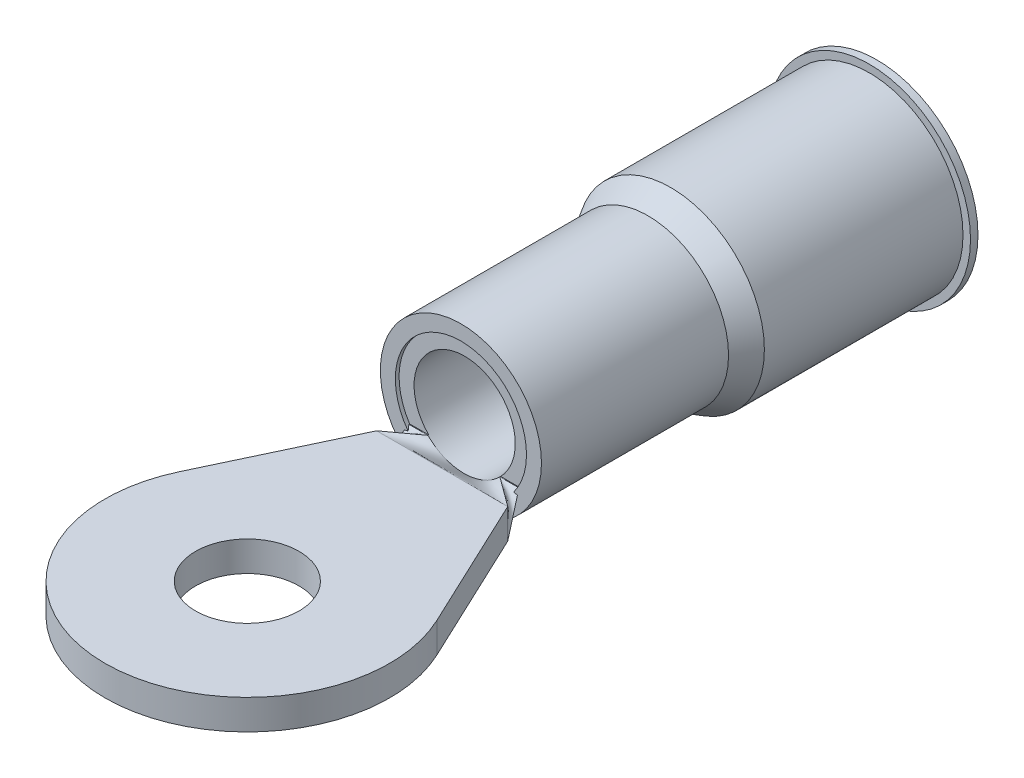
ISO-10303-21;
HEADER;
FILE_DESCRIPTION(('STEP AP214'),'2;1');
FILE_NAME('part.step','',(''),(''),'','','');
FILE_SCHEMA(('AUTOMOTIVE_DESIGN { 1 0 10303 214 1 1 1 1 }'));
ENDSEC;
DATA;
#1=APPLICATION_CONTEXT('core data for automotive mechanical design processes');
#2=APPLICATION_PROTOCOL_DEFINITION('international standard','automotive_design',2000,#1);
#3=PRODUCT_CONTEXT('',#1,'mechanical');
#4=PRODUCT('Part','Part','',(#3));
#5=PRODUCT_RELATED_PRODUCT_CATEGORY('part','',(#4));
#6=PRODUCT_DEFINITION_FORMATION('','',#4);
#7=PRODUCT_DEFINITION_CONTEXT('part definition',#1,'design');
#8=PRODUCT_DEFINITION('design','',#6,#7);
#9=PRODUCT_DEFINITION_SHAPE('','',#8);
#10=(LENGTH_UNIT() NAMED_UNIT(*) SI_UNIT(.MILLI.,.METRE.));
#11=(NAMED_UNIT(*) PLANE_ANGLE_UNIT() SI_UNIT($,.RADIAN.));
#12=(NAMED_UNIT(*) SI_UNIT($,.STERADIAN.) SOLID_ANGLE_UNIT());
#13=UNCERTAINTY_MEASURE_WITH_UNIT(LENGTH_MEASURE(1.E-05),#10,'distance_accuracy_value','');
#14=(GEOMETRIC_REPRESENTATION_CONTEXT(3) GLOBAL_UNCERTAINTY_ASSIGNED_CONTEXT((#13)) GLOBAL_UNIT_ASSIGNED_CONTEXT((#10,
#11,#12)) REPRESENTATION_CONTEXT('',''));
#15=CARTESIAN_POINT('',(0.,0.,0.));
#16=DIRECTION('',(0.,0.,1.));
#17=DIRECTION('',(1.,0.,0.));
#18=AXIS2_PLACEMENT_3D('',#15,#16,#17);
#19=CARTESIAN_POINT('',(-1.86651118400078,1.016,0.0254));
#20=CARTESIAN_POINT('',(-1.98517412266719,0.677333333333334,0.270933333333333));
#21=CARTESIAN_POINT('',(-2.10383706133359,0.338666666666667,0.516466666666667));
#22=CARTESIAN_POINT('',(-2.2225,0.,0.762));
#23=CARTESIAN_POINT('',(-1.76415740937807,0.857653986690439,0.0254));
#24=CARTESIAN_POINT('',(-1.8552021618076,0.571769324460293,0.270933333333333));
#25=CARTESIAN_POINT('',(-1.94624691423714,0.285884662230147,0.516466666666667));
#26=CARTESIAN_POINT('',(-2.03729166666667,0.,0.762));
#27=CARTESIAN_POINT('',(-1.52156969671564,0.572381544803947,0.0254));
#28=CARTESIAN_POINT('',(-1.57000479781043,0.381587696535965,0.270933333333333));
#29=CARTESIAN_POINT('',(-1.61843989890521,0.190793848267982,0.516466666666667));
#30=CARTESIAN_POINT('',(-1.666875,0.,0.762));
#31=CARTESIAN_POINT('',(-0.926796873757692,0.143518849263501,0.0254));
#32=CARTESIAN_POINT('',(-0.926545138060684,0.0956792328423337,0.270933333333333));
#33=CARTESIAN_POINT('',(-0.926293402363676,0.0478396164211668,0.516466666666667));
#34=CARTESIAN_POINT('',(-0.926041666666668,0.,0.762));
#35=CARTESIAN_POINT('',(0.000122281378611678,-0.0963050950338614,0.0254));
#36=CARTESIAN_POINT('',(8.15209190738013E-05,-0.0642033966892409,0.270933333333333));
#37=CARTESIAN_POINT('',(4.07604595359249E-05,-0.0321016983446204,0.516466666666666));
#38=CARTESIAN_POINT('',(0.,0.,0.761999999999999));
#39=CARTESIAN_POINT('',(0.926558741621469,0.143457379872482,0.0254000000000001));
#40=CARTESIAN_POINT('',(0.926386383303201,0.0956382532483216,0.270933333333333));
#41=CARTESIAN_POINT('',(0.926214024984933,0.0478191266241608,0.516466666666667));
#42=CARTESIAN_POINT('',(0.926041666666666,0.,0.762));
#43=CARTESIAN_POINT('',(1.52161395362113,0.57237120881408,0.0254));
#44=CARTESIAN_POINT('',(1.57003430241409,0.381580805876053,0.270933333333333));
#45=CARTESIAN_POINT('',(1.61845465120704,0.190790402938027,0.516466666666667));
#46=CARTESIAN_POINT('',(1.666875,0.,0.762));
#47=CARTESIAN_POINT('',(1.76415740937807,0.857653986690438,0.0254));
#48=CARTESIAN_POINT('',(1.8552021618076,0.571769324460292,0.270933333333333));
#49=CARTESIAN_POINT('',(1.94624691423713,0.285884662230146,0.516466666666667));
#50=CARTESIAN_POINT('',(2.03729166666666,0.,0.762));
#51=CARTESIAN_POINT('',(1.86651118400078,1.016,0.0254));
#52=CARTESIAN_POINT('',(1.98517412266719,0.677333333333333,0.270933333333333));
#53=CARTESIAN_POINT('',(2.10383706133359,0.338666666666666,0.516466666666667));
#54=CARTESIAN_POINT('',(2.2225,0.,0.762));
#55=B_SPLINE_SURFACE_WITH_KNOTS('',3,3,((#19,#20,#21,#22),(#23,#24,#25,#26),(#27,#28,#29,#30),
(#31,#32,#33,#34),(#35,#36,#37,#38),(#39,#40,#41,#42),(#43,#44,#45,#46),(#47,#48,#49,#50),(#51,
#52,#53,#54)),.UNSPECIFIED.,.F.,.F.,.F.,(4,1,1,1,1,1,4),(4,4),(0.,0.125,0.25,0.5,0.75,0.875,1.),
(0.,1.),.UNSPECIFIED.);
#56=DIRECTION('',(0.272905482953707,0.778878319260385,-0.564686781463779));
#57=VECTOR('',#56,1.);
#58=CARTESIAN_POINT('',(-2.04450559200039,0.508,0.3937));
#59=LINE('',#58,#57);
#60=CARTESIAN_POINT('',(-2.2225,0.,0.762));
#61=VERTEX_POINT('',#60);
#62=CARTESIAN_POINT('',(-1.91561308965585,0.875862068965517,0.127));
#63=VERTEX_POINT('',#62);
#64=EDGE_CURVE('E163',#61,#63,#59,.T.);
#65=CARTESIAN_POINT('',(-1.91561308965585,0.875862068965517,0.127));
#66=CARTESIAN_POINT('',(-1.88031346830762,0.83351286184279,0.127));
#67=CARTESIAN_POINT('',(-1.84345220574068,0.792479319937373,0.127));
#68=CARTESIAN_POINT('',(-1.76690702388937,0.713166538929917,0.127));
#69=CARTESIAN_POINT('',(-1.72722430124693,0.674886145852207,0.127));
#70=CARTESIAN_POINT('',(-1.6453538665632,0.601209300898592,0.127));
#71=CARTESIAN_POINT('',(-1.60316909947475,0.565809570480815,0.127));
#72=CARTESIAN_POINT('',(-1.51651304693073,0.497913992094239,0.127));
#73=CARTESIAN_POINT('',(-1.4720412307676,0.465418822959703,0.127));
#74=CARTESIAN_POINT('',(-1.37149298147968,0.397014857809891,0.127));
#75=CARTESIAN_POINT('',(-1.31493333838839,0.361811425932884,0.127));
#76=CARTESIAN_POINT('',(-1.19915375854194,0.296140751778514,0.127));
#77=CARTESIAN_POINT('',(-1.13993382336656,0.265673506688685,0.127));
#78=CARTESIAN_POINT('',(-0.95874434701809,0.181557656021093,0.127));
#79=CARTESIAN_POINT('',(-0.833266823312771,0.135209636342761,0.127));
#80=CARTESIAN_POINT('',(-0.637755102908725,0.0795749988279614,0.127));
#81=CARTESIAN_POINT('',(-0.569624326745305,0.0631336735664818,0.127));
#82=CARTESIAN_POINT('',(-0.432237730962836,0.0357761923262529,0.127));
#83=CARTESIAN_POINT('',(-0.36298192940178,0.0248599477536575,0.127));
#84=CARTESIAN_POINT('',(-0.223824436444734,0.00867844257119852,0.127));
#85=CARTESIAN_POINT('',(-0.153922823091541,0.0034125079333443,0.127));
#86=CARTESIAN_POINT('',(-0.0139239110792396,-0.00125998044247287,0.127));
#87=CARTESIAN_POINT('',(0.0561733761045003,-0.000666870857447165,0.127));
#88=CARTESIAN_POINT('',(0.198186642331982,0.00644182516274476,0.127));
#89=CARTESIAN_POINT('',(0.270093620798593,0.0131357137162563,0.127));
#90=CARTESIAN_POINT('',(0.413109844585491,0.0324871502347966,0.127));
#91=CARTESIAN_POINT('',(0.484218947643138,0.0451457449470441,0.127));
#92=CARTESIAN_POINT('',(0.625194891618926,0.0763223092276175,0.127));
#93=CARTESIAN_POINT('',(0.695060805433234,0.094844472788575,0.127));
#94=CARTESIAN_POINT('',(0.832993419885325,0.137659924457198,0.127));
#95=CARTESIAN_POINT('',(0.901060381220419,0.161952371204842,0.127));
#96=CARTESIAN_POINT('',(1.03537810898253,0.216518828055234,0.127));
#97=CARTESIAN_POINT('',(1.10161060948659,0.246837935402359,0.127));
#98=CARTESIAN_POINT('',(1.23112540724198,0.313256535567639,0.127));
#99=CARTESIAN_POINT('',(1.29440731440598,0.349356789908405,0.127));
#100=CARTESIAN_POINT('',(1.41737528821745,0.42696091284632,0.127));
#101=CARTESIAN_POINT('',(1.47706863508211,0.468453261262636,0.127));
#102=CARTESIAN_POINT('',(1.59254812412097,0.556542904883816,0.127));
#103=CARTESIAN_POINT('',(1.64833531700027,0.603138818580735,0.127));
#104=CARTESIAN_POINT('',(1.73992481230505,0.6870468130533,0.127));
#105=CARTESIAN_POINT('',(1.77684173272019,0.723147862571424,0.127));
#106=CARTESIAN_POINT('',(1.84816469255455,0.797735266465607,0.127));
#107=CARTESIAN_POINT('',(1.8825712235021,0.836221151152803,0.127));
#108=CARTESIAN_POINT('',(1.91561308965585,0.875862068965516,0.127));
#109=B_SPLINE_CURVE_WITH_KNOTS('',3,(#65,#66,#67,#68,#69,#70,#71,#72,#73,#74,#75,#76,#77,#78,
#79,#80,#81,#82,#83,#84,#85,#86,#87,#88,#89,#90,#91,#92,#93,#94,#95,#96,#97,#98,#99,#100,#101,
#102,#103,#104,#105,#106,#107,#108),.UNSPECIFIED.,.F.,.F.,(4,2,2,2,2,2,2,2,2,2,2,2,2,2,2,2,2,2,
2,2,2,4),(0.,0.165342137350006,0.330614563100276,0.495696178609912,0.66081627553718,
0.860436577172999,1.06005676026886,1.45937483535704,1.66946790626083,1.87955760824678,
2.08962224575134,2.29967481242656,2.51607040486528,2.73250398675178,2.94909272663569,
3.16564990526663,3.38389309929961,3.60216506513879,3.81997813379678,4.03773238665957,
4.1925270249401,4.34729127300671),.UNSPECIFIED.);
#110=CARTESIAN_POINT('',(1.91561308965585,0.875862068965517,0.127));
#111=VERTEX_POINT('',#110);
#112=EDGE_CURVE('E268',#63,#111,#109,.T.);
#113=DIRECTION('',(0.272905482953706,-0.778878319260385,0.564686781463779));
#114=VECTOR('',#113,1.);
#115=CARTESIAN_POINT('',(2.04450559200039,0.508,0.3937));
#116=LINE('',#115,#114);
#117=CARTESIAN_POINT('',(2.2225,0.,0.762));
#118=VERTEX_POINT('',#117);
#119=EDGE_CURVE('E161',#111,#118,#116,.T.);
#120=DIRECTION('',(1.,0.,0.));
#121=VECTOR('',#120,1.);
#122=CARTESIAN_POINT('',(0.,0.,0.762));
#123=LINE('',#122,#121);
#124=EDGE_CURVE('E152',#118,#61,#123,.F.);
#125=ORIENTED_EDGE('',*,*,#64,.T.);
#126=ORIENTED_EDGE('',*,*,#112,.T.);
#127=ORIENTED_EDGE('',*,*,#119,.T.);
#128=ORIENTED_EDGE('',*,*,#124,.T.);
#129=EDGE_LOOP('',(#125,#126,#127,#128));
#130=FACE_BOUND('',#129,.T.);
#131=ADVANCED_FACE('F78',(#130),#55,.T.);
#132=CARTESIAN_POINT('',(-1.21814120692143,1.016,0.0254));
#133=CARTESIAN_POINT('',(-1.55292747128095,1.016,0.270933333333333));
#134=CARTESIAN_POINT('',(-1.88771373564048,1.016,0.516466666666667));
#135=CARTESIAN_POINT('',(-2.2225,1.016,0.762));
#136=CARTESIAN_POINT('',(-1.27217203834471,1.016,0.0254));
#137=CARTESIAN_POINT('',(-1.58894802556314,0.987777777777777,0.270933333333333));
#138=CARTESIAN_POINT('',(-1.90572401278157,0.959555555555555,0.516466666666667));
#139=CARTESIAN_POINT('',(-2.2225,0.931333333333333,0.762));
#140=CARTESIAN_POINT('',(-1.38023370119127,1.016,0.0254));
#141=CARTESIAN_POINT('',(-1.66098913412751,0.931333333333332,0.270933333333333));
#142=CARTESIAN_POINT('',(-1.94174456706376,0.846666666666666,0.516466666666667));
#143=CARTESIAN_POINT('',(-2.2225,0.762,0.762));
#144=CARTESIAN_POINT('',(-1.5423261954611,1.016,0.0254));
#145=CARTESIAN_POINT('',(-1.76905079697407,0.846666666666667,0.270933333333333));
#146=CARTESIAN_POINT('',(-1.99577539848704,0.677333333333333,0.516466666666667));
#147=CARTESIAN_POINT('',(-2.2225,0.508,0.762));
#148=CARTESIAN_POINT('',(-1.70441868973095,1.016,0.0254));
#149=CARTESIAN_POINT('',(-1.87711245982063,0.761999999999999,0.270933333333333));
#150=CARTESIAN_POINT('',(-2.04980622991032,0.508,0.516466666666667));
#151=CARTESIAN_POINT('',(-2.2225,0.254,0.762));
#152=CARTESIAN_POINT('',(-1.8124803525775,1.016,0.0254));
#153=CARTESIAN_POINT('',(-1.949153568385,0.705555555555555,0.270933333333333));
#154=CARTESIAN_POINT('',(-2.0858267841925,0.395111111111111,0.516466666666667));
#155=CARTESIAN_POINT('',(-2.2225,0.0846666666666667,0.762));
#156=CARTESIAN_POINT('',(-1.86651118400078,1.016,0.0254));
#157=CARTESIAN_POINT('',(-1.98517412266719,0.677333333333333,0.270933333333333));
#158=CARTESIAN_POINT('',(-2.10383706133359,0.338666666666666,0.516466666666667));
#159=CARTESIAN_POINT('',(-2.2225,0.,0.762));
#160=B_SPLINE_SURFACE_WITH_KNOTS('',3,3,((#132,#133,#134,#135),(#136,#137,#138,#139),(#140,#141,
#142,#143),(#144,#145,#146,#147),(#148,#149,#150,#151),(#152,#153,#154,#155),(#156,#157,#158,
#159)),.UNSPECIFIED.,.F.,.F.,.F.,(4,1,1,1,4),(4,4),(0.84092580565334,0.880694354240005,
0.92046290282667,0.960231451413335,1.),(0.,1.),.UNSPECIFIED.);
#161=CARTESIAN_POINT('',(-1.86651118400078,1.016,0.0254000000000001));
#162=CARTESIAN_POINT('',(-1.8621898983026,1.00931434022097,0.0302490740204463));
#163=CARTESIAN_POINT('',(-1.85786269151016,1.0026991682149,0.0351927535176043));
#164=CARTESIAN_POINT('',(-1.84923429555042,0.989657985593923,0.0452890310326855));
#165=CARTESIAN_POINT('',(-1.84493306772688,0.983231418504407,0.0504408786617088));
#166=CARTESIAN_POINT('',(-1.83637514284163,0.970585156102389,0.060992996866067));
#167=CARTESIAN_POINT('',(-1.83211836676651,0.96436502364961,0.0663926759694745));
#168=CARTESIAN_POINT('',(-1.82366870473624,0.952148099195494,0.0775020339984391));
#169=CARTESIAN_POINT('',(-1.81947588348651,0.94615152553031,0.0832120032503846));
#170=CARTESIAN_POINT('',(-1.81119576733252,0.934428781169385,0.0949986802182849));
#171=CARTESIAN_POINT('',(-1.80710862047376,0.928702981401108,0.101075866435901));
#172=CARTESIAN_POINT('',(-1.79909498490028,0.917581842953821,0.113684670748279));
#173=CARTESIAN_POINT('',(-1.79516931465016,0.912188131932854,0.120218236453412));
#174=CARTESIAN_POINT('',(-1.79136816548423,0.907012886536106,0.126999999998449));
#175=B_SPLINE_CURVE_WITH_KNOTS('',3,(#161,#162,#163,#164,#165,#166,#167,#168,#169,#170,#171,
#172,#173,#174),.UNSPECIFIED.,.F.,.F.,(4,2,2,2,2,2,4),(0.,0.0279649760583425,0.055836843748949,
0.0836453392655018,0.111480317776658,0.139352383310867,0.167351668944471),.UNSPECIFIED.);
#176=CARTESIAN_POINT('',(-1.86651118400078,1.016,0.0254000000000001));
#177=VERTEX_POINT('',#176);
#178=CARTESIAN_POINT('',(-1.79136816548425,0.907012886536092,0.127));
#179=VERTEX_POINT('',#178);
#180=EDGE_CURVE('E237',#177,#179,#175,.T.);
#181=CARTESIAN_POINT('',(-1.35667345424261,1.016,0.127));
#182=CARTESIAN_POINT('',(-1.43928364215626,0.995287887129297,0.127));
#183=CARTESIAN_POINT('',(-1.52189383006991,0.974575774258593,0.127));
#184=CARTESIAN_POINT('',(-1.65635552992894,0.94086339598416,0.127));
#185=CARTESIAN_POINT('',(-1.70820704187433,0.927863130580431,0.127));
#186=CARTESIAN_POINT('',(-1.81191006576509,0.901862599772973,0.127));
#187=CARTESIAN_POINT('',(-1.86376157771047,0.888862334369245,0.127));
#188=CARTESIAN_POINT('',(-1.91561308965585,0.875862068965516,0.127));
#189=B_SPLINE_CURVE_WITH_KNOTS('',3,(#181,#182,#183,#184,#185,#186,#187,#188),.UNSPECIFIED.,.F.,
.F.,(4,2,2,4),(0.,0.255501297257522,0.415870482964452,0.576239668671382),.UNSPECIFIED.);
#190=EDGE_CURVE('E262',#179,#63,#189,.T.);
#191=DIRECTION('',(0.,1.,0.));
#192=VECTOR('',#191,1.);
#193=CARTESIAN_POINT('',(-2.2225,1.016,0.762));
#194=LINE('',#193,#192);
#195=CARTESIAN_POINT('',(-2.2225,1.016,0.762));
#196=VERTEX_POINT('',#195);
#197=EDGE_CURVE('E145',#196,#61,#194,.F.);
#198=DIRECTION('',(-0.806378110106925,0.,0.591400324264692));
#199=VECTOR('',#198,1.);
#200=CARTESIAN_POINT('',(-1.72032060346072,1.016,0.3937));
#201=LINE('',#200,#199);
#202=CARTESIAN_POINT('',(-1.21814120692143,1.016,0.0254));
#203=VERTEX_POINT('',#202);
#204=EDGE_CURVE('E283',#203,#196,#201,.T.);
#205=DIRECTION('',(-1.,0.,0.));
#206=VECTOR('',#205,1.);
#207=CARTESIAN_POINT('',(-1.21814120692143,1.016,0.0254));
#208=LINE('',#207,#206);
#209=EDGE_CURVE('E277',#203,#177,#208,.T.);
#210=ORIENTED_EDGE('',*,*,#180,.T.);
#211=ORIENTED_EDGE('',*,*,#190,.T.);
#212=ORIENTED_EDGE('',*,*,#64,.F.);
#213=ORIENTED_EDGE('',*,*,#197,.F.);
#214=ORIENTED_EDGE('',*,*,#204,.F.);
#215=ORIENTED_EDGE('',*,*,#209,.T.);
#216=EDGE_LOOP('',(#210,#211,#212,#213,#214,#215));
#217=FACE_BOUND('',#216,.T.);
#218=ADVANCED_FACE('F195',(#217),#160,.T.);
#219=CARTESIAN_POINT('',(1.86651118400078,1.016,0.0254));
#220=CARTESIAN_POINT('',(1.98517412266719,0.677333333333333,0.270933333333333));
#221=CARTESIAN_POINT('',(2.10383706133359,0.338666666666666,0.516466666666667));
#222=CARTESIAN_POINT('',(2.2225,0.,0.762));
#223=CARTESIAN_POINT('',(1.8124803525775,1.016,0.0254));
#224=CARTESIAN_POINT('',(1.949153568385,0.705555555555555,0.270933333333333));
#225=CARTESIAN_POINT('',(2.0858267841925,0.395111111111111,0.516466666666667));
#226=CARTESIAN_POINT('',(2.2225,0.0846666666666667,0.762));
#227=CARTESIAN_POINT('',(1.70441868973095,1.016,0.0254));
#228=CARTESIAN_POINT('',(1.87711245982063,0.762,0.270933333333334));
#229=CARTESIAN_POINT('',(2.04980622991032,0.508,0.516466666666667));
#230=CARTESIAN_POINT('',(2.2225,0.254000000000001,0.762000000000001));
#231=CARTESIAN_POINT('',(1.54232619546111,1.016,0.0254));
#232=CARTESIAN_POINT('',(1.76905079697407,0.846666666666666,0.270933333333333));
#233=CARTESIAN_POINT('',(1.99577539848704,0.677333333333333,0.516466666666666));
#234=CARTESIAN_POINT('',(2.2225,0.507999999999999,0.761999999999999));
#235=CARTESIAN_POINT('',(1.38023370119127,1.016,0.0254));
#236=CARTESIAN_POINT('',(1.66098913412751,0.931333333333333,0.270933333333333));
#237=CARTESIAN_POINT('',(1.94174456706376,0.846666666666667,0.516466666666667));
#238=CARTESIAN_POINT('',(2.2225,0.762000000000001,0.762));
#239=CARTESIAN_POINT('',(1.27217203834471,1.016,0.0254));
#240=CARTESIAN_POINT('',(1.58894802556314,0.987777777777778,0.270933333333333));
#241=CARTESIAN_POINT('',(1.90572401278157,0.959555555555555,0.516466666666667));
#242=CARTESIAN_POINT('',(2.2225,0.931333333333333,0.762));
#243=CARTESIAN_POINT('',(1.21814120692143,1.016,0.0254));
#244=CARTESIAN_POINT('',(1.55292747128095,1.016,0.270933333333333));
#245=CARTESIAN_POINT('',(1.88771373564048,1.016,0.516466666666667));
#246=CARTESIAN_POINT('',(2.2225,1.016,0.762));
#247=B_SPLINE_SURFACE_WITH_KNOTS('',3,3,((#219,#220,#221,#222),(#223,#224,#225,#226),(#227,#228,
#229,#230),(#231,#232,#233,#234),(#235,#236,#237,#238),(#239,#240,#241,#242),(#243,#244,#245,
#246)),.UNSPECIFIED.,.F.,.F.,.F.,(4,1,1,1,4),(4,4),(0.,0.0397685485866649,0.0795370971733298,
0.119305645759995,0.15907419434666),(0.,1.),.UNSPECIFIED.);
#248=CARTESIAN_POINT('',(1.91561308965585,0.875862068965517,0.127));
#249=CARTESIAN_POINT('',(1.83300290174219,0.896574181836221,0.127));
#250=CARTESIAN_POINT('',(1.75039271382854,0.917286294706925,0.127));
#251=CARTESIAN_POINT('',(1.61593101396951,0.950998672981357,0.127));
#252=CARTESIAN_POINT('',(1.56407950202413,0.963998938385086,0.127));
#253=CARTESIAN_POINT('',(1.46037647813337,0.989999469192543,0.127));
#254=CARTESIAN_POINT('',(1.40852496618799,1.00299973459627,0.127));
#255=CARTESIAN_POINT('',(1.35667345424261,1.016,0.127));
#256=B_SPLINE_CURVE_WITH_KNOTS('',3,(#248,#249,#250,#251,#252,#253,#254,#255),.UNSPECIFIED.,.F.,
.F.,(4,2,2,4),(0.,0.255501297257528,0.415870482964455,0.576239668671382),.UNSPECIFIED.);
#257=CARTESIAN_POINT('',(1.79136816548339,0.907012886534918,0.127));
#258=VERTEX_POINT('',#257);
#259=EDGE_CURVE('E13',#111,#258,#256,.T.);
#260=CARTESIAN_POINT('',(1.79136816548339,0.907012886534918,0.127));
#261=CARTESIAN_POINT('',(1.79516931464933,0.912188131931705,0.120218236454834));
#262=CARTESIAN_POINT('',(1.79909498489948,0.917581842952716,0.113684670749584));
#263=CARTESIAN_POINT('',(1.80710862047304,0.928702981400102,0.10107586643699));
#264=CARTESIAN_POINT('',(1.81119576733184,0.934428781168434,0.0949986802192751));
#265=CARTESIAN_POINT('',(1.81947588348593,0.946151525529477,0.0832120032511893));
#266=CARTESIAN_POINT('',(1.82366870473571,0.952148099194727,0.077502033999157));
#267=CARTESIAN_POINT('',(1.83211836676608,0.964365023648979,0.0663926759700289));
#268=CARTESIAN_POINT('',(1.83637514284125,0.97058515610183,0.0609929968665448));
#269=CARTESIAN_POINT('',(1.8449330677266,0.983231418503998,0.0504408786620402));
#270=CARTESIAN_POINT('',(1.8492342955502,0.989657985593592,0.045289031032947));
#271=CARTESIAN_POINT('',(1.85786269151005,1.00269916821473,0.0351927535177313));
#272=CARTESIAN_POINT('',(1.86218989830255,1.00931434022088,0.0302490740205087));
#273=CARTESIAN_POINT('',(1.86651118400078,1.016,0.0254));
#274=B_SPLINE_CURVE_WITH_KNOTS('',3,(#260,#261,#262,#263,#264,#265,#266,#267,#268,#269,#270,
#271,#272,#273),.UNSPECIFIED.,.F.,.F.,(4,2,2,2,2,2,4),(0.,0.0279992856339638,0.0558713511685266,
0.0837063296800339,0.111514825196936,0.139386692887896,0.167351668946597),.UNSPECIFIED.);
#275=CARTESIAN_POINT('',(1.86651118400078,1.016,0.0254));
#276=VERTEX_POINT('',#275);
#277=EDGE_CURVE('E89',#258,#276,#274,.T.);
#278=DIRECTION('',(-1.,0.,0.));
#279=VECTOR('',#278,1.);
#280=CARTESIAN_POINT('',(1.86651118400078,1.016,0.0254));
#281=LINE('',#280,#279);
#282=CARTESIAN_POINT('',(1.21814120692143,1.016,0.0254));
#283=VERTEX_POINT('',#282);
#284=EDGE_CURVE('E82',#276,#283,#281,.T.);
#285=DIRECTION('',(0.806378110106925,0.,0.591400324264693));
#286=VECTOR('',#285,1.);
#287=CARTESIAN_POINT('',(1.72032060346071,1.016,0.3937));
#288=LINE('',#287,#286);
#289=CARTESIAN_POINT('',(2.2225,1.016,0.762));
#290=VERTEX_POINT('',#289);
#291=EDGE_CURVE('E181',#283,#290,#288,.T.);
#292=DIRECTION('',(0.,1.,0.));
#293=VECTOR('',#292,1.);
#294=CARTESIAN_POINT('',(2.2225,1.016,0.762));
#295=LINE('',#294,#293);
#296=EDGE_CURVE('E128',#290,#118,#295,.F.);
#297=ORIENTED_EDGE('',*,*,#119,.F.);
#298=ORIENTED_EDGE('',*,*,#259,.T.);
#299=ORIENTED_EDGE('',*,*,#277,.T.);
#300=ORIENTED_EDGE('',*,*,#284,.T.);
#301=ORIENTED_EDGE('',*,*,#291,.T.);
#302=ORIENTED_EDGE('',*,*,#296,.T.);
#303=EDGE_LOOP('',(#297,#298,#299,#300,#301,#302));
#304=FACE_BOUND('',#303,.T.);
#305=ADVANCED_FACE('F183',(#304),#247,.T.);
#306=CARTESIAN_POINT('',(0.,1.016,7.366));
#307=DIRECTION('',(0.,1.,0.));
#308=DIRECTION('',(0.,0.,1.));
#309=AXIS2_PLACEMENT_3D('',#306,#307,#308);
#310=PLANE('',#309);
#311=CARTESIAN_POINT('',(0.,1.016,7.366));
#312=DIRECTION('',(0.,1.,0.));
#313=DIRECTION('',(0.,0.,1.));
#314=AXIS2_PLACEMENT_3D('',#311,#312,#313);
#315=CIRCLE('',#314,4.826);
#316=CARTESIAN_POINT('',(-4.36539668036592,1.016,5.30843157512315));
#317=VERTEX_POINT('',#316);
#318=CARTESIAN_POINT('',(4.36539668036592,1.016,5.30843157512315));
#319=VERTEX_POINT('',#318);
#320=EDGE_CURVE('E131',#317,#319,#315,.T.);
#321=ORIENTED_EDGE('',*,*,#320,.T.);
#322=DIRECTION('',(-0.426350688950861,0.,-0.904557952831728));
#323=VECTOR('',#322,1.);
#324=CARTESIAN_POINT('',(2.2225,1.016,0.762));
#325=LINE('',#324,#323);
#326=EDGE_CURVE('E118',#319,#290,#325,.T.);
#327=ORIENTED_EDGE('',*,*,#326,.T.);
#328=DIRECTION('',(1.,0.,0.));
#329=VECTOR('',#328,1.);
#330=CARTESIAN_POINT('',(0.,1.016,0.762));
#331=LINE('',#330,#329);
#332=EDGE_CURVE('E130',#290,#196,#331,.F.);
#333=ORIENTED_EDGE('',*,*,#332,.T.);
#334=DIRECTION('',(-0.426350688950861,0.,0.904557952831728));
#335=VECTOR('',#334,1.);
#336=CARTESIAN_POINT('',(-2.2225,1.016,0.762));
#337=LINE('',#336,#335);
#338=EDGE_CURVE('E98',#196,#317,#337,.T.);
#339=ORIENTED_EDGE('',*,*,#338,.T.);
#340=EDGE_LOOP('',(#321,#327,#333,#339));
#341=FACE_BOUND('',#340,.T.);
#342=CARTESIAN_POINT('',(0.,1.016,7.366));
#343=DIRECTION('',(0.,1.,0.));
#344=DIRECTION('',(0.,0.,1.));
#345=AXIS2_PLACEMENT_3D('',#342,#343,#344);
#346=CIRCLE('',#345,1.7526);
#347=CARTESIAN_POINT('',(0.,1.016,9.1186));
#348=VERTEX_POINT('',#347);
#349=EDGE_CURVE('E294',#348,#348,#346,.T.);
#350=ORIENTED_EDGE('',*,*,#349,.F.);
#351=EDGE_LOOP('',(#350));
#352=FACE_BOUND('',#351,.T.);
#353=ADVANCED_FACE('F134',(#341,#352),#310,.T.);
#354=CARTESIAN_POINT('',(0.,0.,7.366));
#355=DIRECTION('',(0.,1.,0.));
#356=DIRECTION('',(0.,0.,1.));
#357=AXIS2_PLACEMENT_3D('',#354,#355,#356);
#358=PLANE('',#357);
#359=CARTESIAN_POINT('',(0.,0.,7.366));
#360=DIRECTION('',(0.,1.,0.));
#361=DIRECTION('',(0.,0.,1.));
#362=AXIS2_PLACEMENT_3D('',#359,#360,#361);
#363=CIRCLE('',#362,4.826);
#364=CARTESIAN_POINT('',(-4.36539668036592,0.,5.30843157512315));
#365=VERTEX_POINT('',#364);
#366=CARTESIAN_POINT('',(4.36539668036592,0.,5.30843157512315));
#367=VERTEX_POINT('',#366);
#368=EDGE_CURVE('E141',#365,#367,#363,.T.);
#369=ORIENTED_EDGE('',*,*,#368,.F.);
#370=DIRECTION('',(-0.426350688950861,0.,0.904557952831728));
#371=VECTOR('',#370,1.);
#372=CARTESIAN_POINT('',(-2.2225,0.,0.762));
#373=LINE('',#372,#371);
#374=EDGE_CURVE('E138',#61,#365,#373,.T.);
#375=ORIENTED_EDGE('',*,*,#374,.F.);
#376=ORIENTED_EDGE('',*,*,#124,.F.);
#377=DIRECTION('',(-0.426350688950861,0.,-0.904557952831728));
#378=VECTOR('',#377,1.);
#379=CARTESIAN_POINT('',(2.2225,0.,0.762));
#380=LINE('',#379,#378);
#381=EDGE_CURVE('E151',#367,#118,#380,.T.);
#382=ORIENTED_EDGE('',*,*,#381,.F.);
#383=EDGE_LOOP('',(#369,#375,#376,#382));
#384=FACE_BOUND('',#383,.T.);
#385=CARTESIAN_POINT('',(0.,0.,7.366));
#386=DIRECTION('',(0.,1.,0.));
#387=DIRECTION('',(0.,0.,1.));
#388=AXIS2_PLACEMENT_3D('',#385,#386,#387);
#389=CIRCLE('',#388,1.7526);
#390=CARTESIAN_POINT('',(0.,0.,9.1186));
#391=VERTEX_POINT('',#390);
#392=EDGE_CURVE('E290',#391,#391,#389,.T.);
#393=ORIENTED_EDGE('',*,*,#392,.T.);
#394=EDGE_LOOP('',(#393));
#395=FACE_BOUND('',#394,.T.);
#396=ADVANCED_FACE('F457',(#384,#395),#358,.F.);
#397=CARTESIAN_POINT('',(0.,1.016,7.366));
#398=DIRECTION('',(0.,-1.,0.));
#399=DIRECTION('',(0.,0.,-1.));
#400=AXIS2_PLACEMENT_3D('',#397,#398,#399);
#401=CYLINDRICAL_SURFACE('',#400,4.826);
#402=ORIENTED_EDGE('',*,*,#368,.T.);
#403=DIRECTION('',(0.,-1.,0.));
#404=VECTOR('',#403,1.);
#405=CARTESIAN_POINT('',(4.36539668036592,1.016,5.30843157512315));
#406=LINE('',#405,#404);
#407=EDGE_CURVE('E125',#319,#367,#406,.T.);
#408=ORIENTED_EDGE('',*,*,#407,.F.);
#409=ORIENTED_EDGE('',*,*,#320,.F.);
#410=DIRECTION('',(0.,-1.,0.));
#411=VECTOR('',#410,1.);
#412=CARTESIAN_POINT('',(-4.36539668036592,1.016,5.30843157512315));
#413=LINE('',#412,#411);
#414=EDGE_CURVE('E149',#317,#365,#413,.T.);
#415=ORIENTED_EDGE('',*,*,#414,.T.);
#416=EDGE_LOOP('',(#402,#408,#409,#415));
#417=FACE_BOUND('',#416,.T.);
#418=ADVANCED_FACE('F80',(#417),#401,.T.);
#419=CARTESIAN_POINT('',(2.2225,1.016,0.762));
#420=DIRECTION('',(-0.904557952831728,0.,0.426350688950861));
#421=DIRECTION('',(0.426350688950861,0.,0.904557952831728));
#422=AXIS2_PLACEMENT_3D('',#419,#420,#421);
#423=PLANE('',#422);
#424=ORIENTED_EDGE('',*,*,#381,.T.);
#425=ORIENTED_EDGE('',*,*,#296,.F.);
#426=ORIENTED_EDGE('',*,*,#326,.F.);
#427=ORIENTED_EDGE('',*,*,#407,.T.);
#428=EDGE_LOOP('',(#424,#425,#426,#427));
#429=FACE_BOUND('',#428,.T.);
#430=ADVANCED_FACE('F123',(#429),#423,.F.);
#431=CARTESIAN_POINT('',(-2.2225,1.016,0.762));
#432=DIRECTION('',(0.904557952831728,0.,0.426350688950861));
#433=DIRECTION('',(0.426350688950861,0.,-0.904557952831728));
#434=AXIS2_PLACEMENT_3D('',#431,#432,#433);
#435=PLANE('',#434);
#436=ORIENTED_EDGE('',*,*,#374,.T.);
#437=ORIENTED_EDGE('',*,*,#414,.F.);
#438=ORIENTED_EDGE('',*,*,#338,.F.);
#439=ORIENTED_EDGE('',*,*,#197,.T.);
#440=EDGE_LOOP('',(#436,#437,#438,#439));
#441=FACE_BOUND('',#440,.T.);
#442=ADVANCED_FACE('F454',(#441),#435,.F.);
#443=CARTESIAN_POINT('',(0.,1.016,7.366));
#444=DIRECTION('',(0.,-1.,0.));
#445=DIRECTION('',(0.,0.,-1.));
#446=AXIS2_PLACEMENT_3D('',#443,#444,#445);
#447=CYLINDRICAL_SURFACE('',#446,1.7526);
#448=ORIENTED_EDGE('',*,*,#349,.T.);
#449=EDGE_LOOP('',(#448));
#450=FACE_BOUND('',#449,.T.);
#451=ORIENTED_EDGE('',*,*,#392,.F.);
#452=EDGE_LOOP('',(#451));
#453=FACE_BOUND('',#452,.T.);
#454=ADVANCED_FACE('F247',(#450,#453),#447,.F.);
#455=CARTESIAN_POINT('',(1.21814120692143,1.016,0.0254));
#456=CARTESIAN_POINT('',(1.55292747128095,1.016,0.270933333333333));
#457=CARTESIAN_POINT('',(1.88771373564048,1.016,0.516466666666667));
#458=CARTESIAN_POINT('',(2.2225,1.016,0.762));
#459=CARTESIAN_POINT('',(1.05924529177908,0.855570939207306,0.0254));
#460=CARTESIAN_POINT('',(1.32352463896383,0.90904729280487,0.270933333333333));
#461=CARTESIAN_POINT('',(1.58780398614858,0.962523646402435,0.516466666666667));
#462=CARTESIAN_POINT('',(1.85208333333333,1.016,0.762));
#463=CARTESIAN_POINT('',(0.677372838083658,0.598300647561908,0.0254));
#464=CARTESIAN_POINT('',(0.821998558722438,0.737533765041272,0.270933333333333));
#465=CARTESIAN_POINT('',(0.966624279361218,0.876766882520635,0.516466666666666));
#466=CARTESIAN_POINT('',(1.11125,1.016,0.761999999999999));
#467=CARTESIAN_POINT('',(0.,0.46276665309919,0.0254000000000001));
#468=CARTESIAN_POINT('',(0.,0.647177768732794,0.270933333333334));
#469=CARTESIAN_POINT('',(0.,0.831588884366398,0.516466666666667));
#470=CARTESIAN_POINT('',(0.,1.016,0.762000000000001));
#471=CARTESIAN_POINT('',(-0.677372838083656,0.598300647561908,0.0254));
#472=CARTESIAN_POINT('',(-0.821998558722438,0.737533765041271,0.270933333333333));
#473=CARTESIAN_POINT('',(-0.966624279361219,0.876766882520635,0.516466666666666));
#474=CARTESIAN_POINT('',(-1.11125,1.016,0.761999999999999));
#475=CARTESIAN_POINT('',(-1.05924529177908,0.855570939207306,0.0254));
#476=CARTESIAN_POINT('',(-1.32352463896383,0.909047292804871,0.270933333333333));
#477=CARTESIAN_POINT('',(-1.58780398614858,0.962523646402435,0.516466666666667));
#478=CARTESIAN_POINT('',(-1.85208333333333,1.016,0.762));
#479=CARTESIAN_POINT('',(-1.21814120692143,1.016,0.0254));
#480=CARTESIAN_POINT('',(-1.55292747128095,1.016,0.270933333333333));
#481=CARTESIAN_POINT('',(-1.88771373564048,1.016,0.516466666666667));
#482=CARTESIAN_POINT('',(-2.2225,1.016,0.762));
#483=B_SPLINE_SURFACE_WITH_KNOTS('',3,3,((#455,#456,#457,#458),(#459,#460,#461,#462),(#463,#464,
#465,#466),(#467,#468,#469,#470),(#471,#472,#473,#474),(#475,#476,#477,#478),(#479,#480,#481,
#482)),.UNSPECIFIED.,.F.,.F.,.F.,(4,1,1,1,4),(4,4),(0.15907419434666,0.32953709717333,0.5,
0.67046290282667,0.84092580565334),(0.,1.),.UNSPECIFIED.);
#484=CARTESIAN_POINT('',(0.,2.2225,0.0254));
#485=DIRECTION('',(0.,0.,-1.));
#486=DIRECTION('',(1.,0.,0.));
#487=AXIS2_PLACEMENT_3D('',#484,#485,#486);
#488=CIRCLE('',#487,1.7145);
#489=CARTESIAN_POINT('',(0.808172289089683,0.710311896002232,0.0254));
#490=VERTEX_POINT('',#489);
#491=EDGE_CURVE('E291',#283,#490,#488,.T.);
#492=CARTESIAN_POINT('',(0.808121801451822,0.710406718485779,0.0254));
#493=CARTESIAN_POINT('',(0.792666501144398,0.702134471805026,0.0254));
#494=CARTESIAN_POINT('',(0.777084352484752,0.694099076624601,0.0254));
#495=CARTESIAN_POINT('',(0.745680916808394,0.678511702332572,0.0254));
#496=CARTESIAN_POINT('',(0.729859639552435,0.670959703555212,0.0254));
#497=CARTESIAN_POINT('',(0.697991602911585,0.656348324465218,0.0254));
#498=CARTESIAN_POINT('',(0.681944848607313,0.649288933074103,0.0254));
#499=CARTESIAN_POINT('',(0.649639445274306,0.635672448204834,0.0254));
#500=CARTESIAN_POINT('',(0.633380794291363,0.629115359362987,0.0254));
#501=CARTESIAN_POINT('',(0.600667726112671,0.61650726232971,0.0254));
#502=CARTESIAN_POINT('',(0.584213301080716,0.610456274474246,0.0254));
#503=CARTESIAN_POINT('',(0.551125047514309,0.598863440215858,0.0254));
#504=CARTESIAN_POINT('',(0.534491208929865,0.593321622501744,0.0254));
#505=CARTESIAN_POINT('',(0.501060422776744,0.582750388951325,0.0254));
#506=CARTESIAN_POINT('',(0.484263465494368,0.577721003837815,0.0254));
#507=CARTESIAN_POINT('',(0.450522751527506,0.568177850846072,0.0254));
#508=CARTESIAN_POINT('',(0.433578987008371,0.563664110670837,0.0254));
#509=CARTESIAN_POINT('',(0.399560962164823,0.555155481788707,0.0254));
#510=CARTESIAN_POINT('',(0.382486696601996,0.551160614026809,0.0254));
#511=CARTESIAN_POINT('',(0.348223973951207,0.543692964279535,0.0254));
#512=CARTESIAN_POINT('',(0.331035514293163,0.54022019408647,0.0254));
#513=CARTESIAN_POINT('',(0.296560707459203,0.533799977191001,0.0254));
#514=CARTESIAN_POINT('',(0.279274359981379,0.53085253210972,0.0254));
#515=CARTESIAN_POINT('',(0.244620081999156,0.525486203921547,0.0254));
#516=CARTESIAN_POINT('',(0.227252152758546,0.523067312654187,0.0254));
#517=CARTESIAN_POINT('',(0.192451016723375,0.518761330257706,0.0254));
#518=CARTESIAN_POINT('',(0.175017811922559,0.51687422301815,0.0254));
#519=CARTESIAN_POINT('',(0.140102430029886,0.513635045016886,0.0254));
#520=CARTESIAN_POINT('',(0.122620254863866,0.51228295350427,0.0254));
#521=CARTESIAN_POINT('',(0.0876232421049947,0.510117039874273,0.0254));
#522=CARTESIAN_POINT('',(0.0701084057857916,0.509303197190127,0.0254));
#523=CARTESIAN_POINT('',(0.0350623666538257,0.508217009685602,0.0254));
#524=CARTESIAN_POINT('',(0.0175311642761116,0.507944650859551,0.0254));
#525=CARTESIAN_POINT('',(-0.0175312404674233,0.507944651647309,0.0254));
#526=CARTESIAN_POINT('',(-0.035062442833244,0.508217011261131,0.0254));
#527=CARTESIAN_POINT('',(-0.0701084819178122,0.509303200335238,0.0254));
#528=CARTESIAN_POINT('',(-0.0876233182015098,0.510117043801212,0.0254));
#529=CARTESIAN_POINT('',(-0.122620330865746,0.512282958990512,0.0254));
#530=CARTESIAN_POINT('',(-0.140102505972635,0.513635051280607,0.0254));
#531=CARTESIAN_POINT('',(-0.175017887723425,0.516874230832059,0.0254));
#532=CARTESIAN_POINT('',(-0.192451092441489,0.518761338844322,0.0254));
#533=CARTESIAN_POINT('',(-0.227252228287532,0.523067322781568,0.0254));
#534=CARTESIAN_POINT('',(-0.244620157421767,0.525486214816978,0.0254));
#535=CARTESIAN_POINT('',(-0.279274435167617,0.530852544536578,0.0254));
#536=CARTESIAN_POINT('',(-0.296560782515444,0.533799990381224,0.0254));
#537=CARTESIAN_POINT('',(-0.331035589065785,0.540220208798762,0.0254));
#538=CARTESIAN_POINT('',(-0.348224048570209,0.543692979750519,0.0254));
#539=CARTESIAN_POINT('',(-0.382486770890134,0.551160631010511,0.0254));
#540=CARTESIAN_POINT('',(-0.399561036275719,0.555155499526422,0.0254));
#541=CARTESIAN_POINT('',(-0.433579060741153,0.563664129911927,0.0254));
#542=CARTESIAN_POINT('',(-0.450522825059419,0.568177870836512,0.0254));
#543=CARTESIAN_POINT('',(-0.48426353860093,0.577721025322261,0.0254));
#544=CARTESIAN_POINT('',(-0.501060495658825,0.58275041118042,0.0254));
#545=CARTESIAN_POINT('',(-0.534491281339313,0.593321646215581,0.0254));
#546=CARTESIAN_POINT('',(-0.551125119675604,0.598863464669787,0.0254));
#547=CARTESIAN_POINT('',(-0.584213372722256,0.61045630040327,0.0254));
#548=CARTESIAN_POINT('',(-0.600667797482606,0.616507288993747,0.0254));
#549=CARTESIAN_POINT('',(-0.633380865093818,0.629115387493907,0.0254));
#550=CARTESIAN_POINT('',(-0.64963951578088,0.635672477067644,0.0254));
#551=CARTESIAN_POINT('',(-0.681944918500999,0.649288963389819,0.0254));
#552=CARTESIAN_POINT('',(-0.697991672488256,0.656348355501976,0.0254));
#553=CARTESIAN_POINT('',(-0.729859708475583,0.670959736019889,0.0254));
#554=CARTESIAN_POINT('',(-0.745680985395028,0.678511735504144,0.0254));
#555=CARTESIAN_POINT('',(-0.777084420378545,0.694099111196481,0.0254));
#556=CARTESIAN_POINT('',(-0.792666568681859,0.702134507070328,0.0254));
#557=CARTESIAN_POINT('',(-0.808121868622918,0.710406754438074,0.0254));
#558=B_SPLINE_CURVE_WITH_KNOTS('',3,(#492,#493,#494,#495,#496,#497,#498,#499,#500,#501,#502,
#503,#504,#505,#506,#507,#508,#509,#510,#511,#512,#513,#514,#515,#516,#517,#518,#519,#520,#521,
#522,#523,#524,#525,#526,#527,#528,#529,#530,#531,#532,#533,#534,#535,#536,#537,#538,#539,#540,
#541,#542,#543,#544,#545,#546,#547,#548,#549,#550,#551,#552,#553,#554,#555,#556,#557),
.UNSPECIFIED.,.F.,.F.,(4,2,2,2,2,2,2,2,2,2,2,2,2,2,2,2,2,2,2,2,2,2,2,2,2,2,2,2,2,2,2,2,4),(0.,
0.0525876534587561,0.105173166160597,0.157757495860436,0.210342310860798,0.262929237790833,
0.315519125877021,0.368112165126591,0.420708028607071,0.473306014532333,0.525905188278907,
0.578504524340566,0.63110304825117,0.683699978514339,0.736294868573691,0.788887748839179,
0.841479268753399,0.89407078866877,0.946663668936865,0.999258558999284,1.05185548926518,
1.10445401317759,1.15705334923975,1.20965252298534,1.26225050890817,1.31484637238499,
1.36743941163013,1.42002929971174,1.47261622663793,1.52520104163622,1.57778537133673,
1.63037088404114,1.68295853750337),.UNSPECIFIED.);
#559=CARTESIAN_POINT('',(-0.80815779266977,0.710339307501548,0.0254));
#560=VERTEX_POINT('',#559);
#561=EDGE_CURVE('E367',#490,#560,#558,.T.);
#562=CARTESIAN_POINT('',(-0.808121868622918,0.710406754438074,0.0254));
#563=CARTESIAN_POINT('',(-0.826976230768144,0.720498271551122,0.0254));
#564=CARTESIAN_POINT('',(-0.845641862232535,0.730942198915355,0.0254));
#565=CARTESIAN_POINT('',(-0.882572121156501,0.752518618587443,0.0254));
#566=CARTESIAN_POINT('',(-0.900836727958959,0.763651146253456,0.0254));
#567=CARTESIAN_POINT('',(-0.936940081350788,0.786587870125409,0.0254));
#568=CARTESIAN_POINT('',(-0.954778813070757,0.798392089734888,0.0254));
#569=CARTESIAN_POINT('',(-0.990005605065968,0.822655349662502,0.0254));
#570=CARTESIAN_POINT('',(-1.007393659334,0.835114398702348,0.0254));
#571=CARTESIAN_POINT('',(-1.04169426991106,0.860670463070999,0.0254));
#572=CARTESIAN_POINT('',(-1.0586068297006,0.873767473728137,0.0254));
#573=CARTESIAN_POINT('',(-1.091931621509,0.900582600381976,0.0254));
#574=CARTESIAN_POINT('',(-1.10834386410561,0.914300703232222,0.0254));
#575=CARTESIAN_POINT('',(-1.14064321627997,0.942341178208931,0.0254));
#576=CARTESIAN_POINT('',(-1.1565303375438,0.956663536872069,0.0254));
#577=CARTESIAN_POINT('',(-1.18775456189219,0.98589556536936,0.0254));
#578=CARTESIAN_POINT('',(-1.20309166758463,1.0008052324181,0.0254));
#579=CARTESIAN_POINT('',(-1.21814120692143,1.016,0.0254));
#580=B_SPLINE_CURVE_WITH_KNOTS('',3,(#562,#563,#564,#565,#566,#567,#568,#569,#570,#571,#572,
#573,#574,#575,#576,#577,#578,#579),.UNSPECIFIED.,.F.,.F.,(4,2,2,2,2,2,2,2,4),(0.,
0.064151654964065,0.128306606717757,0.192463795171591,0.256621838355466,0.320779411793375,
0.384935627863264,0.449090415233191,0.513244898374477),.UNSPECIFIED.);
#581=EDGE_CURVE('E411',#560,#203,#580,.T.);
#582=ORIENTED_EDGE('',*,*,#491,.T.);
#583=ORIENTED_EDGE('',*,*,#561,.T.);
#584=ORIENTED_EDGE('',*,*,#581,.T.);
#585=ORIENTED_EDGE('',*,*,#204,.T.);
#586=ORIENTED_EDGE('',*,*,#332,.F.);
#587=ORIENTED_EDGE('',*,*,#291,.F.);
#588=EDGE_LOOP('',(#582,#583,#584,#585,#586,#587));
#589=FACE_BOUND('',#588,.T.);
#590=ADVANCED_FACE('F200',(#589),#483,.T.);
#591=CARTESIAN_POINT('',(0.,2.2225,-6.35));
#592=DIRECTION('',(0.,0.,1.));
#593=DIRECTION('',(1.,0.,0.));
#594=AXIS2_PLACEMENT_3D('',#591,#592,#593);
#595=PLANE('',#594);
#596=CARTESIAN_POINT('',(0.,2.2225,-6.35));
#597=DIRECTION('',(0.,0.,1.));
#598=DIRECTION('',(1.,0.,0.));
#599=AXIS2_PLACEMENT_3D('',#596,#597,#598);
#600=CIRCLE('',#599,1.7145);
#601=CARTESIAN_POINT('',(1.7145,2.2225,-6.35));
#602=VERTEX_POINT('',#601);
#603=EDGE_CURVE('E409',#602,#602,#600,.T.);
#604=ORIENTED_EDGE('',*,*,#603,.T.);
#605=EDGE_LOOP('',(#604));
#606=FACE_BOUND('',#605,.T.);
#607=CARTESIAN_POINT('',(0.,2.2225,-6.35));
#608=DIRECTION('',(0.,0.,1.));
#609=DIRECTION('',(1.,0.,0.));
#610=AXIS2_PLACEMENT_3D('',#607,#608,#609);
#611=CIRCLE('',#610,2.2225);
#612=CARTESIAN_POINT('',(2.2225,2.2225,-6.35));
#613=VERTEX_POINT('',#612);
#614=EDGE_CURVE('E408',#613,#613,#611,.T.);
#615=ORIENTED_EDGE('',*,*,#614,.F.);
#616=EDGE_LOOP('',(#615));
#617=FACE_BOUND('',#616,.T.);
#618=ADVANCED_FACE('F344',(#606,#617),#595,.F.);
#619=CARTESIAN_POINT('',(0.,2.2225,0.));
#620=DIRECTION('',(0.,0.,1.));
#621=DIRECTION('',(1.,0.,0.));
#622=AXIS2_PLACEMENT_3D('',#619,#620,#621);
#623=PLANE('',#622);
#624=DIRECTION('',(-1.,0.,0.));
#625=VECTOR('',#624,1.);
#626=CARTESIAN_POINT('',(-1.21814120692143,1.016,0.));
#627=LINE('',#626,#625);
#628=CARTESIAN_POINT('',(-1.21814120692143,1.016,0.));
#629=VERTEX_POINT('',#628);
#630=CARTESIAN_POINT('',(-1.86651118400078,1.016,0.));
#631=VERTEX_POINT('',#630);
#632=EDGE_CURVE('E405',#629,#631,#627,.T.);
#633=ORIENTED_EDGE('',*,*,#632,.F.);
#634=CARTESIAN_POINT('',(0.,2.2225,0.));
#635=DIRECTION('',(0.,0.,1.));
#636=DIRECTION('',(1.,0.,0.));
#637=AXIS2_PLACEMENT_3D('',#634,#635,#636);
#638=CIRCLE('',#637,1.7145);
#639=CARTESIAN_POINT('',(1.21814120692143,1.016,0.));
#640=VERTEX_POINT('',#639);
#641=EDGE_CURVE('E427',#640,#629,#638,.T.);
#642=ORIENTED_EDGE('',*,*,#641,.F.);
#643=DIRECTION('',(-1.,0.,0.));
#644=VECTOR('',#643,1.);
#645=CARTESIAN_POINT('',(1.86651118400078,1.016,0.));
#646=LINE('',#645,#644);
#647=CARTESIAN_POINT('',(1.86651118400078,1.016,0.));
#648=VERTEX_POINT('',#647);
#649=EDGE_CURVE('E407',#648,#640,#646,.T.);
#650=ORIENTED_EDGE('',*,*,#649,.F.);
#651=CARTESIAN_POINT('',(0.,2.2225,0.));
#652=DIRECTION('',(0.,0.,1.));
#653=DIRECTION('',(1.,0.,0.));
#654=AXIS2_PLACEMENT_3D('',#651,#652,#653);
#655=CIRCLE('',#654,2.2225);
#656=EDGE_CURVE('E398',#648,#631,#655,.T.);
#657=ORIENTED_EDGE('',*,*,#656,.T.);
#658=EDGE_LOOP('',(#633,#642,#650,#657));
#659=FACE_BOUND('',#658,.T.);
#660=ADVANCED_FACE('F342',(#659),#623,.T.);
#661=CARTESIAN_POINT('',(0.,2.2225,-6.35));
#662=DIRECTION('',(0.,0.,1.));
#663=DIRECTION('',(1.,0.,0.));
#664=AXIS2_PLACEMENT_3D('',#661,#662,#663);
#665=CYLINDRICAL_SURFACE('',#664,1.7145);
#666=ORIENTED_EDGE('',*,*,#603,.F.);
#667=EDGE_LOOP('',(#666));
#668=FACE_BOUND('',#667,.T.);
#669=ORIENTED_EDGE('',*,*,#641,.T.);
#670=DIRECTION('',(0.,0.,-1.));
#671=VECTOR('',#670,1.);
#672=CARTESIAN_POINT('',(-1.21814120692143,1.016,0.0254));
#673=LINE('',#672,#671);
#674=EDGE_CURVE('E402',#203,#629,#673,.T.);
#675=ORIENTED_EDGE('',*,*,#674,.F.);
#676=ORIENTED_EDGE('',*,*,#581,.F.);
#677=ORIENTED_EDGE('',*,*,#561,.F.);
#678=ORIENTED_EDGE('',*,*,#491,.F.);
#679=DIRECTION('',(0.,0.,-1.));
#680=VECTOR('',#679,1.);
#681=CARTESIAN_POINT('',(1.21814120692143,1.016,0.0254));
#682=LINE('',#681,#680);
#683=EDGE_CURVE('E364',#283,#640,#682,.T.);
#684=ORIENTED_EDGE('',*,*,#683,.T.);
#685=EDGE_LOOP('',(#669,#675,#676,#677,#678,#684));
#686=FACE_BOUND('',#685,.T.);
#687=ADVANCED_FACE('F336',(#668,#686),#665,.F.);
#688=CARTESIAN_POINT('',(1.86651118400078,1.016,0.0254));
#689=DIRECTION('',(0.,-1.,0.));
#690=DIRECTION('',(1.,0.,0.));
#691=AXIS2_PLACEMENT_3D('',#688,#689,#690);
#692=PLANE('',#691);
#693=ORIENTED_EDGE('',*,*,#649,.T.);
#694=ORIENTED_EDGE('',*,*,#683,.F.);
#695=ORIENTED_EDGE('',*,*,#284,.F.);
#696=DIRECTION('',(0.,0.,-1.));
#697=VECTOR('',#696,1.);
#698=CARTESIAN_POINT('',(1.86651118400078,1.016,0.0254));
#699=LINE('',#698,#697);
#700=EDGE_CURVE('E433',#276,#648,#699,.T.);
#701=ORIENTED_EDGE('',*,*,#700,.T.);
#702=EDGE_LOOP('',(#693,#694,#695,#701));
#703=FACE_BOUND('',#702,.T.);
#704=ADVANCED_FACE('F327',(#703),#692,.F.);
#705=CARTESIAN_POINT('',(-1.21814120692143,1.016,0.0254));
#706=DIRECTION('',(0.,-1.,0.));
#707=DIRECTION('',(0.,0.,-1.));
#708=AXIS2_PLACEMENT_3D('',#705,#706,#707);
#709=PLANE('',#708);
#710=ORIENTED_EDGE('',*,*,#632,.T.);
#711=DIRECTION('',(0.,0.,-1.));
#712=VECTOR('',#711,1.);
#713=CARTESIAN_POINT('',(-1.86651118400078,1.016,0.0254));
#714=LINE('',#713,#712);
#715=EDGE_CURVE('E396',#177,#631,#714,.T.);
#716=ORIENTED_EDGE('',*,*,#715,.F.);
#717=ORIENTED_EDGE('',*,*,#209,.F.);
#718=ORIENTED_EDGE('',*,*,#674,.T.);
#719=EDGE_LOOP('',(#710,#716,#717,#718));
#720=FACE_BOUND('',#719,.T.);
#721=ADVANCED_FACE('F335',(#720),#709,.F.);
#722=CARTESIAN_POINT('',(0.,2.2225,-6.35));
#723=DIRECTION('',(0.,0.,-1.));
#724=DIRECTION('',(-1.,0.,0.));
#725=AXIS2_PLACEMENT_3D('',#722,#723,#724);
#726=CONICAL_SURFACE('',#725,2.2225,0.5235987755983);
#727=CARTESIAN_POINT('',(0.,2.2225,-7.11989658396436));
#728=DIRECTION('',(0.,0.,1.));
#729=DIRECTION('',(1.,0.,0.));
#730=AXIS2_PLACEMENT_3D('',#727,#728,#729);
#731=CIRCLE('',#730,2.667);
#732=CARTESIAN_POINT('',(2.667,2.2225,-7.11989658396436));
#733=VERTEX_POINT('',#732);
#734=EDGE_CURVE('E413',#733,#733,#731,.T.);
#735=ORIENTED_EDGE('',*,*,#734,.F.);
#736=EDGE_LOOP('',(#735));
#737=FACE_BOUND('',#736,.T.);
#738=ORIENTED_EDGE('',*,*,#614,.T.);
#739=EDGE_LOOP('',(#738));
#740=FACE_BOUND('',#739,.T.);
#741=ADVANCED_FACE('F553',(#737,#740),#726,.F.);
#742=CARTESIAN_POINT('',(0.,2.2225,-6.35));
#743=DIRECTION('',(0.,0.,1.));
#744=DIRECTION('',(1.,0.,0.));
#745=AXIS2_PLACEMENT_3D('',#742,#743,#744);
#746=CYLINDRICAL_SURFACE('',#745,2.667);
#747=CARTESIAN_POINT('',(0.,2.2225,-13.97));
#748=DIRECTION('',(0.,0.,1.));
#749=DIRECTION('',(1.,0.,0.));
#750=AXIS2_PLACEMENT_3D('',#747,#748,#749);
#751=CIRCLE('',#750,2.667);
#752=CARTESIAN_POINT('',(2.667,2.2225,-13.97));
#753=VERTEX_POINT('',#752);
#754=EDGE_CURVE('E674',#753,#753,#751,.T.);
#755=ORIENTED_EDGE('',*,*,#754,.F.);
#756=EDGE_LOOP('',(#755));
#757=FACE_BOUND('',#756,.T.);
#758=ORIENTED_EDGE('',*,*,#734,.T.);
#759=EDGE_LOOP('',(#758));
#760=FACE_BOUND('',#759,.T.);
#761=ADVANCED_FACE('F561',(#757,#760),#746,.F.);
#762=CARTESIAN_POINT('',(0.,5.6515,-13.97));
#763=DIRECTION('',(0.,0.,1.));
#764=DIRECTION('',(1.,0.,0.));
#765=AXIS2_PLACEMENT_3D('',#762,#763,#764);
#766=PLANE('',#765);
#767=CARTESIAN_POINT('',(0.,2.2225,-13.97));
#768=DIRECTION('',(0.,0.,1.));
#769=DIRECTION('',(1.,0.,0.));
#770=AXIS2_PLACEMENT_3D('',#767,#768,#769);
#771=CIRCLE('',#770,3.429);
#772=CARTESIAN_POINT('',(3.429,2.2225,-13.97));
#773=VERTEX_POINT('',#772);
#774=EDGE_CURVE('E671',#773,#773,#771,.T.);
#775=ORIENTED_EDGE('',*,*,#774,.F.);
#776=EDGE_LOOP('',(#775));
#777=FACE_BOUND('',#776,.T.);
#778=ORIENTED_EDGE('',*,*,#754,.T.);
#779=EDGE_LOOP('',(#778));
#780=FACE_BOUND('',#779,.T.);
#781=ADVANCED_FACE('F570',(#777,#780),#766,.F.);
#782=CARTESIAN_POINT('',(0.,2.2225,-6.35));
#783=DIRECTION('',(0.,0.,1.));
#784=DIRECTION('',(1.,0.,0.));
#785=AXIS2_PLACEMENT_3D('',#782,#783,#784);
#786=CYLINDRICAL_SURFACE('',#785,3.429);
#787=CARTESIAN_POINT('',(0.,2.2225,-13.716));
#788=DIRECTION('',(0.,0.,1.));
#789=DIRECTION('',(1.,0.,0.));
#790=AXIS2_PLACEMENT_3D('',#787,#788,#789);
#791=CIRCLE('',#790,3.429);
#792=CARTESIAN_POINT('',(3.429,2.2225,-13.716));
#793=VERTEX_POINT('',#792);
#794=EDGE_CURVE('E668',#793,#793,#791,.T.);
#795=ORIENTED_EDGE('',*,*,#794,.F.);
#796=EDGE_LOOP('',(#795));
#797=FACE_BOUND('',#796,.T.);
#798=ORIENTED_EDGE('',*,*,#774,.T.);
#799=EDGE_LOOP('',(#798));
#800=FACE_BOUND('',#799,.T.);
#801=ADVANCED_FACE('F580',(#797,#800),#786,.T.);
#802=CARTESIAN_POINT('',(0.,5.3975,-13.716));
#803=DIRECTION('',(0.,0.,-1.));
#804=DIRECTION('',(-1.,0.,0.));
#805=AXIS2_PLACEMENT_3D('',#802,#803,#804);
#806=PLANE('',#805);
#807=CARTESIAN_POINT('',(0.,2.2225,-13.716));
#808=DIRECTION('',(0.,0.,1.));
#809=DIRECTION('',(1.,0.,0.));
#810=AXIS2_PLACEMENT_3D('',#807,#808,#809);
#811=CIRCLE('',#810,3.175);
#812=CARTESIAN_POINT('',(3.175,2.2225,-13.716));
#813=VERTEX_POINT('',#812);
#814=EDGE_CURVE('E661',#813,#813,#811,.T.);
#815=ORIENTED_EDGE('',*,*,#814,.F.);
#816=EDGE_LOOP('',(#815));
#817=FACE_BOUND('',#816,.T.);
#818=ORIENTED_EDGE('',*,*,#794,.T.);
#819=EDGE_LOOP('',(#818));
#820=FACE_BOUND('',#819,.T.);
#821=ADVANCED_FACE('F591',(#817,#820),#806,.F.);
#822=CARTESIAN_POINT('',(0.,2.2225,-6.35));
#823=DIRECTION('',(0.,0.,1.));
#824=DIRECTION('',(1.,0.,0.));
#825=AXIS2_PLACEMENT_3D('',#822,#823,#824);
#826=CYLINDRICAL_SURFACE('',#825,3.175);
#827=CARTESIAN_POINT('',(0.,2.2225,-6.98377839420935));
#828=DIRECTION('',(0.,0.,1.));
#829=DIRECTION('',(1.,0.,0.));
#830=AXIS2_PLACEMENT_3D('',#827,#828,#829);
#831=CIRCLE('',#830,3.175);
#832=CARTESIAN_POINT('',(3.175,2.2225,-6.98377839420935));
#833=VERTEX_POINT('',#832);
#834=EDGE_CURVE('E658',#833,#833,#831,.T.);
#835=ORIENTED_EDGE('',*,*,#834,.F.);
#836=EDGE_LOOP('',(#835));
#837=FACE_BOUND('',#836,.T.);
#838=ORIENTED_EDGE('',*,*,#814,.T.);
#839=EDGE_LOOP('',(#838));
#840=FACE_BOUND('',#839,.T.);
#841=ADVANCED_FACE('F601',(#837,#840),#826,.T.);
#842=CARTESIAN_POINT('',(0.,2.2225,-6.98377839420935));
#843=DIRECTION('',(0.,0.,-1.));
#844=DIRECTION('',(-1.,0.,0.));
#845=AXIS2_PLACEMENT_3D('',#842,#843,#844);
#846=CONICAL_SURFACE('',#845,3.175,0.523598775598301);
#847=CARTESIAN_POINT('',(0.,2.2225,-6.21388181024499));
#848=DIRECTION('',(0.,0.,1.));
#849=DIRECTION('',(1.,0.,0.));
#850=AXIS2_PLACEMENT_3D('',#847,#848,#849);
#851=CIRCLE('',#850,2.7305);
#852=CARTESIAN_POINT('',(2.7305,2.2225,-6.21388181024499));
#853=VERTEX_POINT('',#852);
#854=EDGE_CURVE('E657',#853,#853,#851,.T.);
#855=ORIENTED_EDGE('',*,*,#854,.F.);
#856=EDGE_LOOP('',(#855));
#857=FACE_BOUND('',#856,.T.);
#858=ORIENTED_EDGE('',*,*,#834,.T.);
#859=EDGE_LOOP('',(#858));
#860=FACE_BOUND('',#859,.T.);
#861=ADVANCED_FACE('F611',(#857,#860),#846,.T.);
#862=CARTESIAN_POINT('',(0.,2.2225,-6.35));
#863=DIRECTION('',(0.,0.,1.));
#864=DIRECTION('',(1.,0.,0.));
#865=AXIS2_PLACEMENT_3D('',#862,#863,#864);
#866=CYLINDRICAL_SURFACE('',#865,2.7305);
#867=CARTESIAN_POINT('',(0.,2.2225,0.127));
#868=DIRECTION('',(0.,0.,1.));
#869=DIRECTION('',(1.,0.,0.));
#870=AXIS2_PLACEMENT_3D('',#867,#868,#869);
#871=CIRCLE('',#870,2.7305);
#872=CARTESIAN_POINT('',(2.7305,2.2225,0.127));
#873=VERTEX_POINT('',#872);
#874=EDGE_CURVE('E654',#873,#873,#871,.T.);
#875=ORIENTED_EDGE('',*,*,#874,.F.);
#876=EDGE_LOOP('',(#875));
#877=FACE_BOUND('',#876,.T.);
#878=ORIENTED_EDGE('',*,*,#854,.T.);
#879=EDGE_LOOP('',(#878));
#880=FACE_BOUND('',#879,.T.);
#881=ADVANCED_FACE('F621',(#877,#880),#866,.T.);
#882=CARTESIAN_POINT('',(0.,4.445,0.127));
#883=DIRECTION('',(0.,0.,-1.));
#884=DIRECTION('',(-1.,0.,0.));
#885=AXIS2_PLACEMENT_3D('',#882,#883,#884);
#886=PLANE('',#885);
#887=ORIENTED_EDGE('',*,*,#190,.F.);
#888=CARTESIAN_POINT('',(0.,2.2225,0.127));
#889=DIRECTION('',(0.,0.,1.));
#890=DIRECTION('',(1.,0.,0.));
#891=AXIS2_PLACEMENT_3D('',#888,#889,#890);
#892=CIRCLE('',#891,2.2225);
#893=EDGE_CURVE('E443',#258,#179,#892,.T.);
#894=ORIENTED_EDGE('',*,*,#893,.F.);
#895=ORIENTED_EDGE('',*,*,#259,.F.);
#896=ORIENTED_EDGE('',*,*,#112,.F.);
#897=EDGE_LOOP('',(#887,#894,#895,#896));
#898=FACE_BOUND('',#897,.T.);
#899=ORIENTED_EDGE('',*,*,#874,.T.);
#900=EDGE_LOOP('',(#899));
#901=FACE_BOUND('',#900,.T.);
#902=ADVANCED_FACE('F225',(#898,#901),#886,.F.);
#903=CARTESIAN_POINT('',(0.,2.2225,-6.35));
#904=DIRECTION('',(0.,0.,1.));
#905=DIRECTION('',(1.,0.,0.));
#906=AXIS2_PLACEMENT_3D('',#903,#904,#905);
#907=CYLINDRICAL_SURFACE('',#906,2.2225);
#908=ORIENTED_EDGE('',*,*,#180,.F.);
#909=ORIENTED_EDGE('',*,*,#715,.T.);
#910=ORIENTED_EDGE('',*,*,#656,.F.);
#911=ORIENTED_EDGE('',*,*,#700,.F.);
#912=ORIENTED_EDGE('',*,*,#277,.F.);
#913=ORIENTED_EDGE('',*,*,#893,.T.);
#914=EDGE_LOOP('',(#908,#909,#910,#911,#912,#913));
#915=FACE_BOUND('',#914,.T.);
#916=ADVANCED_FACE('F222',(#915),#907,.F.);
#917=CLOSED_SHELL('',(#131,#218,#305,#353,#396,#418,#430,#442,#454,#590,#618,#660,#687,#704,
#721,#741,#761,#781,#801,#821,#841,#861,#881,#902,#916));
#918=MANIFOLD_SOLID_BREP('B2',#917);
#919=ADVANCED_BREP_SHAPE_REPRESENTATION('',(#18,#918),#14);
#920=SHAPE_DEFINITION_REPRESENTATION(#9,#919);
ENDSEC;
END-ISO-10303-21;
